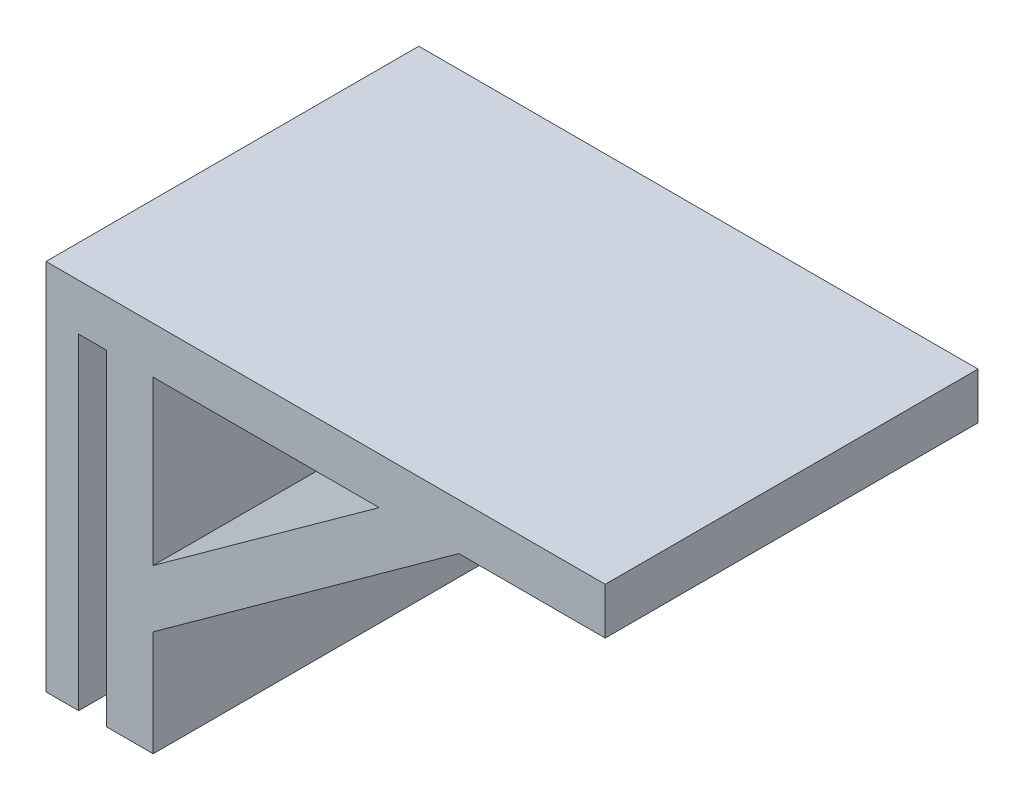
ISO-10303-21;
HEADER;
FILE_DESCRIPTION(('STEP AP214'),'2;1');
FILE_NAME('part.step','',(''),(''),'','','');
FILE_SCHEMA(('AUTOMOTIVE_DESIGN { 1 0 10303 214 1 1 1 1 }'));
ENDSEC;
DATA;
#1=APPLICATION_CONTEXT('core data for automotive mechanical design processes');
#2=APPLICATION_PROTOCOL_DEFINITION('international standard','automotive_design',2000,#1);
#3=PRODUCT_CONTEXT('',#1,'mechanical');
#4=PRODUCT('Part','Part','',(#3));
#5=PRODUCT_RELATED_PRODUCT_CATEGORY('part','',(#4));
#6=PRODUCT_DEFINITION_FORMATION('','',#4);
#7=PRODUCT_DEFINITION_CONTEXT('part definition',#1,'design');
#8=PRODUCT_DEFINITION('design','',#6,#7);
#9=PRODUCT_DEFINITION_SHAPE('','',#8);
#10=(LENGTH_UNIT() NAMED_UNIT(*) SI_UNIT(.MILLI.,.METRE.));
#11=(NAMED_UNIT(*) PLANE_ANGLE_UNIT() SI_UNIT($,.RADIAN.));
#12=(NAMED_UNIT(*) SI_UNIT($,.STERADIAN.) SOLID_ANGLE_UNIT());
#13=UNCERTAINTY_MEASURE_WITH_UNIT(LENGTH_MEASURE(1.E-05),#10,'distance_accuracy_value','');
#14=(GEOMETRIC_REPRESENTATION_CONTEXT(3) GLOBAL_UNCERTAINTY_ASSIGNED_CONTEXT((#13)) GLOBAL_UNIT_ASSIGNED_CONTEXT((#10,
#11,#12)) REPRESENTATION_CONTEXT('',''));
#15=CARTESIAN_POINT('',(0.,0.,0.));
#16=DIRECTION('',(0.,0.,1.));
#17=DIRECTION('',(1.,0.,0.));
#18=AXIS2_PLACEMENT_3D('',#15,#16,#17);
#19=CARTESIAN_POINT('',(23.,70.,80.));
#20=DIRECTION('',(1.,0.,0.));
#21=DIRECTION('',(0.,1.,0.));
#22=AXIS2_PLACEMENT_3D('',#19,#20,#21);
#23=PLANE('',#22);
#24=DIRECTION('',(0.,0.,-1.));
#25=VECTOR('',#24,1.);
#26=CARTESIAN_POINT('',(23.,35.,80.));
#27=LINE('',#26,#25);
#28=CARTESIAN_POINT('',(23.,35.,80.));
#29=VERTEX_POINT('',#28);
#30=CARTESIAN_POINT('',(23.,35.,0.));
#31=VERTEX_POINT('',#30);
#32=EDGE_CURVE('E461',#29,#31,#27,.T.);
#33=ORIENTED_EDGE('',*,*,#32,.T.);
#34=DIRECTION('',(0.,-1.,0.));
#35=VECTOR('',#34,1.);
#36=CARTESIAN_POINT('',(23.,70.,0.));
#37=LINE('',#36,#35);
#38=CARTESIAN_POINT('',(23.,70.,0.));
#39=VERTEX_POINT('',#38);
#40=EDGE_CURVE('E192',#39,#31,#37,.T.);
#41=ORIENTED_EDGE('',*,*,#40,.F.);
#42=DIRECTION('',(0.,0.,-1.));
#43=VECTOR('',#42,1.);
#44=CARTESIAN_POINT('',(23.,70.,80.));
#45=LINE('',#44,#43);
#46=CARTESIAN_POINT('',(23.,70.,80.));
#47=VERTEX_POINT('',#46);
#48=EDGE_CURVE('E228',#47,#39,#45,.T.);
#49=ORIENTED_EDGE('',*,*,#48,.F.);
#50=DIRECTION('',(0.,-1.,0.));
#51=VECTOR('',#50,1.);
#52=CARTESIAN_POINT('',(23.,70.,80.));
#53=LINE('',#52,#51);
#54=EDGE_CURVE('E168',#47,#29,#53,.T.);
#55=ORIENTED_EDGE('',*,*,#54,.T.);
#56=EDGE_LOOP('',(#33,#41,#49,#55));
#57=FACE_BOUND('',#56,.T.);
#58=ADVANCED_FACE('F39',(#57),#23,.T.);
#59=CARTESIAN_POINT('',(120.,70.,80.));
#60=DIRECTION('',(0.,-1.,0.));
#61=DIRECTION('',(1.,0.,0.));
#62=AXIS2_PLACEMENT_3D('',#59,#60,#61);
#63=PLANE('',#62);
#64=DIRECTION('',(0.,0.,-1.));
#65=VECTOR('',#64,1.);
#66=CARTESIAN_POINT('',(71.5,70.,80.));
#67=LINE('',#66,#65);
#68=CARTESIAN_POINT('',(71.5,70.,80.));
#69=VERTEX_POINT('',#68);
#70=CARTESIAN_POINT('',(71.5000000000003,70.0000000000001,0.));
#71=VERTEX_POINT('',#70);
#72=EDGE_CURVE('E188',#69,#71,#67,.T.);
#73=ORIENTED_EDGE('',*,*,#72,.F.);
#74=DIRECTION('',(-1.,0.,0.));
#75=VECTOR('',#74,1.);
#76=CARTESIAN_POINT('',(120.,70.,80.));
#77=LINE('',#76,#75);
#78=EDGE_CURVE('E164',#69,#47,#77,.T.);
#79=ORIENTED_EDGE('',*,*,#78,.T.);
#80=ORIENTED_EDGE('',*,*,#48,.T.);
#81=DIRECTION('',(-1.,0.,0.));
#82=VECTOR('',#81,1.);
#83=CARTESIAN_POINT('',(120.,70.,0.));
#84=LINE('',#83,#82);
#85=EDGE_CURVE('E194',#71,#39,#84,.T.);
#86=ORIENTED_EDGE('',*,*,#85,.F.);
#87=EDGE_LOOP('',(#73,#79,#80,#86));
#88=FACE_BOUND('',#87,.T.);
#89=ADVANCED_FACE('F278',(#88),#63,.T.);
#90=CARTESIAN_POINT('',(13.,70.,80.));
#91=DIRECTION('',(1.,0.,0.));
#92=DIRECTION('',(0.,1.,0.));
#93=AXIS2_PLACEMENT_3D('',#90,#91,#92);
#94=PLANE('',#93);
#95=DIRECTION('',(0.,-1.,0.));
#96=VECTOR('',#95,1.);
#97=CARTESIAN_POINT('',(13.,70.,0.));
#98=LINE('',#97,#96);
#99=CARTESIAN_POINT('',(13.,70.,0.));
#100=VERTEX_POINT('',#99);
#101=CARTESIAN_POINT('',(13.,0.,0.));
#102=VERTEX_POINT('',#101);
#103=EDGE_CURVE('E184',#100,#102,#98,.T.);
#104=ORIENTED_EDGE('',*,*,#103,.T.);
#105=DIRECTION('',(0.,0.,-1.));
#106=VECTOR('',#105,1.);
#107=CARTESIAN_POINT('',(13.,0.,80.));
#108=LINE('',#107,#106);
#109=CARTESIAN_POINT('',(13.,0.,80.));
#110=VERTEX_POINT('',#109);
#111=EDGE_CURVE('E11',#110,#102,#108,.T.);
#112=ORIENTED_EDGE('',*,*,#111,.F.);
#113=DIRECTION('',(0.,-1.,0.));
#114=VECTOR('',#113,1.);
#115=CARTESIAN_POINT('',(13.,70.,80.));
#116=LINE('',#115,#114);
#117=CARTESIAN_POINT('',(13.,70.,80.));
#118=VERTEX_POINT('',#117);
#119=EDGE_CURVE('E212',#118,#110,#116,.T.);
#120=ORIENTED_EDGE('',*,*,#119,.F.);
#121=DIRECTION('',(0.,0.,-1.));
#122=VECTOR('',#121,1.);
#123=CARTESIAN_POINT('',(13.,70.,80.));
#124=LINE('',#123,#122);
#125=EDGE_CURVE('E183',#118,#100,#124,.T.);
#126=ORIENTED_EDGE('',*,*,#125,.T.);
#127=EDGE_LOOP('',(#104,#112,#120,#126));
#128=FACE_BOUND('',#127,.T.);
#129=ADVANCED_FACE('F41',(#128),#94,.F.);
#130=CARTESIAN_POINT('',(13.,0.,80.));
#131=DIRECTION('',(0.,1.,0.));
#132=DIRECTION('',(-1.,0.,0.));
#133=AXIS2_PLACEMENT_3D('',#130,#131,#132);
#134=PLANE('',#133);
#135=DIRECTION('',(1.,0.,0.));
#136=VECTOR('',#135,1.);
#137=CARTESIAN_POINT('',(13.,0.,0.));
#138=LINE('',#137,#136);
#139=CARTESIAN_POINT('',(23.,0.,0.));
#140=VERTEX_POINT('',#139);
#141=EDGE_CURVE('E187',#102,#140,#138,.T.);
#142=ORIENTED_EDGE('',*,*,#141,.T.);
#143=DIRECTION('',(0.,0.,-1.));
#144=VECTOR('',#143,1.);
#145=CARTESIAN_POINT('',(23.,0.,80.));
#146=LINE('',#145,#144);
#147=CARTESIAN_POINT('',(23.,0.,80.));
#148=VERTEX_POINT('',#147);
#149=EDGE_CURVE('E47',#148,#140,#146,.T.);
#150=ORIENTED_EDGE('',*,*,#149,.F.);
#151=DIRECTION('',(1.,0.,0.));
#152=VECTOR('',#151,1.);
#153=CARTESIAN_POINT('',(13.,0.,80.));
#154=LINE('',#153,#152);
#155=EDGE_CURVE('E472',#110,#148,#154,.T.);
#156=ORIENTED_EDGE('',*,*,#155,.F.);
#157=ORIENTED_EDGE('',*,*,#111,.T.);
#158=EDGE_LOOP('',(#142,#150,#156,#157));
#159=FACE_BOUND('',#158,.T.);
#160=ADVANCED_FACE('F236',(#159),#134,.F.);
#161=DIRECTION('',(0.,0.,-1.));
#162=VECTOR('',#161,1.);
#163=CARTESIAN_POINT('',(23.,22.6680172781049,80.));
#164=LINE('',#163,#162);
#165=CARTESIAN_POINT('',(23.,22.6680172781049,80.));
#166=VERTEX_POINT('',#165);
#167=CARTESIAN_POINT('',(23.,22.6680172781049,0.));
#168=VERTEX_POINT('',#167);
#169=EDGE_CURVE('E147',#166,#168,#164,.T.);
#170=ORIENTED_EDGE('',*,*,#169,.F.);
#171=EDGE_CURVE('E159',#166,#148,#53,.T.);
#172=ORIENTED_EDGE('',*,*,#171,.T.);
#173=ORIENTED_EDGE('',*,*,#149,.T.);
#174=EDGE_CURVE('E191',#168,#140,#37,.T.);
#175=ORIENTED_EDGE('',*,*,#174,.F.);
#176=EDGE_LOOP('',(#170,#172,#173,#175));
#177=FACE_BOUND('',#176,.T.);
#178=ADVANCED_FACE('F234',(#177),#23,.T.);
#179=DIRECTION('',(0.,0.,-1.));
#180=VECTOR('',#179,1.);
#181=CARTESIAN_POINT('',(88.5886046289118,70.,80.));
#182=LINE('',#181,#180);
#183=CARTESIAN_POINT('',(88.5886046289118,70.,80.));
#184=VERTEX_POINT('',#183);
#185=CARTESIAN_POINT('',(88.5886046289118,70.,0.));
#186=VERTEX_POINT('',#185);
#187=EDGE_CURVE('E139',#184,#186,#182,.T.);
#188=ORIENTED_EDGE('',*,*,#187,.T.);
#189=CARTESIAN_POINT('',(120.,70.,0.));
#190=VERTEX_POINT('',#189);
#191=EDGE_CURVE('E195',#190,#186,#84,.T.);
#192=ORIENTED_EDGE('',*,*,#191,.F.);
#193=DIRECTION('',(0.,0.,-1.));
#194=VECTOR('',#193,1.);
#195=CARTESIAN_POINT('',(120.,70.,80.));
#196=LINE('',#195,#194);
#197=CARTESIAN_POINT('',(120.,70.,80.));
#198=VERTEX_POINT('',#197);
#199=EDGE_CURVE('E162',#198,#190,#196,.T.);
#200=ORIENTED_EDGE('',*,*,#199,.F.);
#201=EDGE_CURVE('E156',#198,#184,#77,.T.);
#202=ORIENTED_EDGE('',*,*,#201,.T.);
#203=EDGE_LOOP('',(#188,#192,#200,#202));
#204=FACE_BOUND('',#203,.T.);
#205=ADVANCED_FACE('F161',(#204),#63,.T.);
#206=CARTESIAN_POINT('',(120.,80.,80.));
#207=DIRECTION('',(1.,0.,0.));
#208=DIRECTION('',(0.,1.,0.));
#209=AXIS2_PLACEMENT_3D('',#206,#207,#208);
#210=PLANE('',#209);
#211=DIRECTION('',(0.,-1.,0.));
#212=VECTOR('',#211,1.);
#213=CARTESIAN_POINT('',(120.,80.,0.));
#214=LINE('',#213,#212);
#215=CARTESIAN_POINT('',(120.,80.,0.));
#216=VERTEX_POINT('',#215);
#217=EDGE_CURVE('E197',#216,#190,#214,.T.);
#218=ORIENTED_EDGE('',*,*,#217,.F.);
#219=DIRECTION('',(0.,0.,-1.));
#220=VECTOR('',#219,1.);
#221=CARTESIAN_POINT('',(120.,80.,80.));
#222=LINE('',#221,#220);
#223=CARTESIAN_POINT('',(120.,80.,80.));
#224=VERTEX_POINT('',#223);
#225=EDGE_CURVE('E225',#224,#216,#222,.T.);
#226=ORIENTED_EDGE('',*,*,#225,.F.);
#227=DIRECTION('',(0.,-1.,0.));
#228=VECTOR('',#227,1.);
#229=CARTESIAN_POINT('',(120.,80.,80.));
#230=LINE('',#229,#228);
#231=EDGE_CURVE('E163',#224,#198,#230,.T.);
#232=ORIENTED_EDGE('',*,*,#231,.T.);
#233=ORIENTED_EDGE('',*,*,#199,.T.);
#234=EDGE_LOOP('',(#218,#226,#232,#233));
#235=FACE_BOUND('',#234,.T.);
#236=ADVANCED_FACE('F267',(#235),#210,.T.);
#237=CARTESIAN_POINT('',(0.,80.,80.));
#238=DIRECTION('',(0.,1.,0.));
#239=DIRECTION('',(-1.,0.,0.));
#240=AXIS2_PLACEMENT_3D('',#237,#238,#239);
#241=PLANE('',#240);
#242=DIRECTION('',(1.,0.,0.));
#243=VECTOR('',#242,1.);
#244=CARTESIAN_POINT('',(0.,80.,0.));
#245=LINE('',#244,#243);
#246=CARTESIAN_POINT('',(0.,80.,0.));
#247=VERTEX_POINT('',#246);
#248=EDGE_CURVE('E200',#247,#216,#245,.T.);
#249=ORIENTED_EDGE('',*,*,#248,.F.);
#250=DIRECTION('',(0.,0.,-1.));
#251=VECTOR('',#250,1.);
#252=CARTESIAN_POINT('',(0.,80.,80.));
#253=LINE('',#252,#251);
#254=CARTESIAN_POINT('',(0.,80.,80.));
#255=VERTEX_POINT('',#254);
#256=EDGE_CURVE('E223',#255,#247,#253,.T.);
#257=ORIENTED_EDGE('',*,*,#256,.F.);
#258=DIRECTION('',(1.,0.,0.));
#259=VECTOR('',#258,1.);
#260=CARTESIAN_POINT('',(0.,80.,80.));
#261=LINE('',#260,#259);
#262=EDGE_CURVE('E166',#255,#224,#261,.T.);
#263=ORIENTED_EDGE('',*,*,#262,.T.);
#264=ORIENTED_EDGE('',*,*,#225,.T.);
#265=EDGE_LOOP('',(#249,#257,#263,#264));
#266=FACE_BOUND('',#265,.T.);
#267=ADVANCED_FACE('F264',(#266),#241,.T.);
#268=CARTESIAN_POINT('',(0.,0.,80.));
#269=DIRECTION('',(-1.,0.,0.));
#270=DIRECTION('',(0.,0.,1.));
#271=AXIS2_PLACEMENT_3D('',#268,#269,#270);
#272=PLANE('',#271);
#273=DIRECTION('',(0.,1.,0.));
#274=VECTOR('',#273,1.);
#275=CARTESIAN_POINT('',(0.,0.,0.));
#276=LINE('',#275,#274);
#277=CARTESIAN_POINT('',(0.,0.,0.));
#278=VERTEX_POINT('',#277);
#279=EDGE_CURVE('E203',#278,#247,#276,.T.);
#280=ORIENTED_EDGE('',*,*,#279,.F.);
#281=DIRECTION('',(0.,0.,-1.));
#282=VECTOR('',#281,1.);
#283=CARTESIAN_POINT('',(0.,0.,80.));
#284=LINE('',#283,#282);
#285=CARTESIAN_POINT('',(0.,0.,80.));
#286=VERTEX_POINT('',#285);
#287=EDGE_CURVE('E221',#286,#278,#284,.T.);
#288=ORIENTED_EDGE('',*,*,#287,.F.);
#289=DIRECTION('',(0.,1.,0.));
#290=VECTOR('',#289,1.);
#291=CARTESIAN_POINT('',(0.,0.,80.));
#292=LINE('',#291,#290);
#293=EDGE_CURVE('E174',#286,#255,#292,.T.);
#294=ORIENTED_EDGE('',*,*,#293,.T.);
#295=ORIENTED_EDGE('',*,*,#256,.T.);
#296=EDGE_LOOP('',(#280,#288,#294,#295));
#297=FACE_BOUND('',#296,.T.);
#298=ADVANCED_FACE('F258',(#297),#272,.T.);
#299=CARTESIAN_POINT('',(0.,0.,80.));
#300=DIRECTION('',(0.,1.,0.));
#301=DIRECTION('',(0.,0.,1.));
#302=AXIS2_PLACEMENT_3D('',#299,#300,#301);
#303=PLANE('',#302);
#304=DIRECTION('',(1.,0.,0.));
#305=VECTOR('',#304,1.);
#306=CARTESIAN_POINT('',(0.,0.,0.));
#307=LINE('',#306,#305);
#308=CARTESIAN_POINT('',(7.,0.,0.));
#309=VERTEX_POINT('',#308);
#310=EDGE_CURVE('E206',#278,#309,#307,.T.);
#311=ORIENTED_EDGE('',*,*,#310,.T.);
#312=DIRECTION('',(0.,0.,-1.));
#313=VECTOR('',#312,1.);
#314=CARTESIAN_POINT('',(7.,0.,80.));
#315=LINE('',#314,#313);
#316=CARTESIAN_POINT('',(7.,0.,80.));
#317=VERTEX_POINT('',#316);
#318=EDGE_CURVE('E218',#317,#309,#315,.T.);
#319=ORIENTED_EDGE('',*,*,#318,.F.);
#320=DIRECTION('',(1.,0.,0.));
#321=VECTOR('',#320,1.);
#322=CARTESIAN_POINT('',(0.,0.,80.));
#323=LINE('',#322,#321);
#324=EDGE_CURVE('E177',#286,#317,#323,.T.);
#325=ORIENTED_EDGE('',*,*,#324,.F.);
#326=ORIENTED_EDGE('',*,*,#287,.T.);
#327=EDGE_LOOP('',(#311,#319,#325,#326));
#328=FACE_BOUND('',#327,.T.);
#329=ADVANCED_FACE('F268',(#328),#303,.F.);
#330=CARTESIAN_POINT('',(7.,0.,80.));
#331=DIRECTION('',(-1.,0.,0.));
#332=DIRECTION('',(0.,0.,1.));
#333=AXIS2_PLACEMENT_3D('',#330,#331,#332);
#334=PLANE('',#333);
#335=DIRECTION('',(0.,1.,0.));
#336=VECTOR('',#335,1.);
#337=CARTESIAN_POINT('',(7.,0.,0.));
#338=LINE('',#337,#336);
#339=CARTESIAN_POINT('',(7.,70.,0.));
#340=VERTEX_POINT('',#339);
#341=EDGE_CURVE('E208',#309,#340,#338,.T.);
#342=ORIENTED_EDGE('',*,*,#341,.T.);
#343=DIRECTION('',(0.,0.,-1.));
#344=VECTOR('',#343,1.);
#345=CARTESIAN_POINT('',(7.,70.,80.));
#346=LINE('',#345,#344);
#347=CARTESIAN_POINT('',(7.,70.,80.));
#348=VERTEX_POINT('',#347);
#349=EDGE_CURVE('E215',#348,#340,#346,.T.);
#350=ORIENTED_EDGE('',*,*,#349,.F.);
#351=DIRECTION('',(0.,1.,0.));
#352=VECTOR('',#351,1.);
#353=CARTESIAN_POINT('',(7.,0.,80.));
#354=LINE('',#353,#352);
#355=EDGE_CURVE('E179',#317,#348,#354,.T.);
#356=ORIENTED_EDGE('',*,*,#355,.F.);
#357=ORIENTED_EDGE('',*,*,#318,.T.);
#358=EDGE_LOOP('',(#342,#350,#356,#357));
#359=FACE_BOUND('',#358,.T.);
#360=ADVANCED_FACE('F252',(#359),#334,.F.);
#361=CARTESIAN_POINT('',(7.,70.,80.));
#362=DIRECTION('',(0.,1.,0.));
#363=DIRECTION('',(0.,0.,1.));
#364=AXIS2_PLACEMENT_3D('',#361,#362,#363);
#365=PLANE('',#364);
#366=DIRECTION('',(1.,0.,0.));
#367=VECTOR('',#366,1.);
#368=CARTESIAN_POINT('',(7.,70.,0.));
#369=LINE('',#368,#367);
#370=EDGE_CURVE('E210',#340,#100,#369,.T.);
#371=ORIENTED_EDGE('',*,*,#370,.T.);
#372=ORIENTED_EDGE('',*,*,#125,.F.);
#373=DIRECTION('',(1.,0.,0.));
#374=VECTOR('',#373,1.);
#375=CARTESIAN_POINT('',(7.,70.,80.));
#376=LINE('',#375,#374);
#377=EDGE_CURVE('E181',#348,#118,#376,.T.);
#378=ORIENTED_EDGE('',*,*,#377,.F.);
#379=ORIENTED_EDGE('',*,*,#349,.T.);
#380=EDGE_LOOP('',(#371,#372,#378,#379));
#381=FACE_BOUND('',#380,.T.);
#382=ADVANCED_FACE('F248',(#381),#365,.F.);
#383=CARTESIAN_POINT('',(0.,0.,80.));
#384=DIRECTION('',(0.,0.,1.));
#385=DIRECTION('',(1.,0.,0.));
#386=AXIS2_PLACEMENT_3D('',#383,#384,#385);
#387=PLANE('',#386);
#388=DIRECTION('',(-0.810899611645196,-0.585185286754265,0.));
#389=VECTOR('',#388,1.);
#390=CARTESIAN_POINT('',(23.,22.6680172781049,80.));
#391=LINE('',#390,#389);
#392=EDGE_CURVE('E142',#184,#166,#391,.T.);
#393=ORIENTED_EDGE('',*,*,#392,.F.);
#394=ORIENTED_EDGE('',*,*,#201,.F.);
#395=ORIENTED_EDGE('',*,*,#231,.F.);
#396=ORIENTED_EDGE('',*,*,#262,.F.);
#397=ORIENTED_EDGE('',*,*,#293,.F.);
#398=ORIENTED_EDGE('',*,*,#324,.T.);
#399=ORIENTED_EDGE('',*,*,#355,.T.);
#400=ORIENTED_EDGE('',*,*,#377,.T.);
#401=ORIENTED_EDGE('',*,*,#119,.T.);
#402=ORIENTED_EDGE('',*,*,#155,.T.);
#403=ORIENTED_EDGE('',*,*,#171,.F.);
#404=EDGE_LOOP('',(#393,#394,#395,#396,#397,#398,#399,#400,#401,#402,#403));
#405=FACE_BOUND('',#404,.T.);
#406=ORIENTED_EDGE('',*,*,#78,.F.);
#407=DIRECTION('',(0.810899611645195,0.585185286754265,0.));
#408=VECTOR('',#407,1.);
#409=CARTESIAN_POINT('',(71.5,70.,80.));
#410=LINE('',#409,#408);
#411=EDGE_CURVE('E148',#29,#69,#410,.T.);
#412=ORIENTED_EDGE('',*,*,#411,.F.);
#413=ORIENTED_EDGE('',*,*,#54,.F.);
#414=EDGE_LOOP('',(#406,#412,#413));
#415=FACE_BOUND('',#414,.T.);
#416=ADVANCED_FACE('F153',(#405,#415),#387,.T.);
#417=CARTESIAN_POINT('',(0.,0.,0.));
#418=DIRECTION('',(0.,0.,1.));
#419=DIRECTION('',(1.,0.,0.));
#420=AXIS2_PLACEMENT_3D('',#417,#418,#419);
#421=PLANE('',#420);
#422=ORIENTED_EDGE('',*,*,#191,.T.);
#423=DIRECTION('',(-0.810899611645196,-0.585185286754265,0.));
#424=VECTOR('',#423,1.);
#425=CARTESIAN_POINT('',(23.,22.6680172781049,0.));
#426=LINE('',#425,#424);
#427=EDGE_CURVE('E54',#186,#168,#426,.T.);
#428=ORIENTED_EDGE('',*,*,#427,.T.);
#429=ORIENTED_EDGE('',*,*,#174,.T.);
#430=ORIENTED_EDGE('',*,*,#141,.F.);
#431=ORIENTED_EDGE('',*,*,#103,.F.);
#432=ORIENTED_EDGE('',*,*,#370,.F.);
#433=ORIENTED_EDGE('',*,*,#341,.F.);
#434=ORIENTED_EDGE('',*,*,#310,.F.);
#435=ORIENTED_EDGE('',*,*,#279,.T.);
#436=ORIENTED_EDGE('',*,*,#248,.T.);
#437=ORIENTED_EDGE('',*,*,#217,.T.);
#438=EDGE_LOOP('',(#422,#428,#429,#430,#431,#432,#433,#434,#435,#436,#437));
#439=FACE_BOUND('',#438,.T.);
#440=DIRECTION('',(0.810899611645195,0.585185286754265,0.));
#441=VECTOR('',#440,1.);
#442=CARTESIAN_POINT('',(71.5,70.,0.));
#443=LINE('',#442,#441);
#444=EDGE_CURVE('E62',#31,#71,#443,.T.);
#445=ORIENTED_EDGE('',*,*,#444,.T.);
#446=ORIENTED_EDGE('',*,*,#85,.T.);
#447=ORIENTED_EDGE('',*,*,#40,.T.);
#448=EDGE_LOOP('',(#445,#446,#447));
#449=FACE_BOUND('',#448,.T.);
#450=ADVANCED_FACE('F239',(#439,#449),#421,.F.);
#451=CARTESIAN_POINT('',(71.5,70.,80.));
#452=DIRECTION('',(-0.585185286754265,0.810899611645195,0.));
#453=DIRECTION('',(-0.810899611645196,-0.585185286754265,0.));
#454=AXIS2_PLACEMENT_3D('',#451,#452,#453);
#455=PLANE('',#454);
#456=ORIENTED_EDGE('',*,*,#444,.F.);
#457=ORIENTED_EDGE('',*,*,#32,.F.);
#458=ORIENTED_EDGE('',*,*,#411,.T.);
#459=ORIENTED_EDGE('',*,*,#72,.T.);
#460=EDGE_LOOP('',(#456,#457,#458,#459));
#461=FACE_BOUND('',#460,.T.);
#462=ADVANCED_FACE('F411',(#461),#455,.T.);
#463=CARTESIAN_POINT('',(23.,22.6680172781049,80.));
#464=DIRECTION('',(0.585185286754265,-0.810899611645196,0.));
#465=DIRECTION('',(0.810899611645196,0.585185286754265,0.));
#466=AXIS2_PLACEMENT_3D('',#463,#464,#465);
#467=PLANE('',#466);
#468=ORIENTED_EDGE('',*,*,#427,.F.);
#469=ORIENTED_EDGE('',*,*,#187,.F.);
#470=ORIENTED_EDGE('',*,*,#392,.T.);
#471=ORIENTED_EDGE('',*,*,#169,.T.);
#472=EDGE_LOOP('',(#468,#469,#470,#471));
#473=FACE_BOUND('',#472,.T.);
#474=ADVANCED_FACE('F141',(#473),#467,.T.);
#475=CLOSED_SHELL('',(#58,#89,#129,#160,#178,#205,#236,#267,#298,#329,#360,#382,#416,#450,#462,#474));
#476=MANIFOLD_SOLID_BREP('B2',#475);
#477=ADVANCED_BREP_SHAPE_REPRESENTATION('',(#18,#476),#14);
#478=SHAPE_DEFINITION_REPRESENTATION(#9,#477);
ENDSEC;
END-ISO-10303-21;
